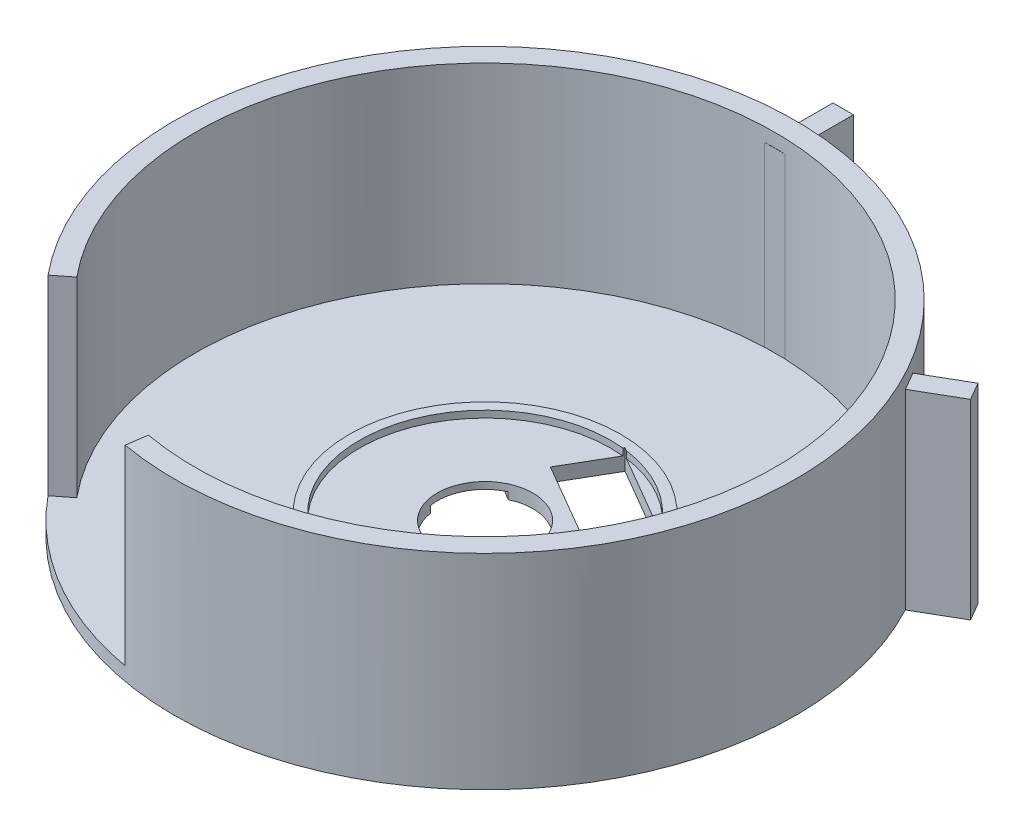
ISO-10303-21;
HEADER;
FILE_DESCRIPTION(('STEP AP214'),'2;1');
FILE_NAME('part.step','',(''),(''),'','','');
FILE_SCHEMA(('AUTOMOTIVE_DESIGN { 1 0 10303 214 1 1 1 1 }'));
ENDSEC;
DATA;
#1=APPLICATION_CONTEXT('core data for automotive mechanical design processes');
#2=APPLICATION_PROTOCOL_DEFINITION('international standard','automotive_design',2000,#1);
#3=PRODUCT_CONTEXT('',#1,'mechanical');
#4=PRODUCT('Part','Part','',(#3));
#5=PRODUCT_RELATED_PRODUCT_CATEGORY('part','',(#4));
#6=PRODUCT_DEFINITION_FORMATION('','',#4);
#7=PRODUCT_DEFINITION_CONTEXT('part definition',#1,'design');
#8=PRODUCT_DEFINITION('design','',#6,#7);
#9=PRODUCT_DEFINITION_SHAPE('','',#8);
#10=(LENGTH_UNIT() NAMED_UNIT(*) SI_UNIT(.MILLI.,.METRE.));
#11=(NAMED_UNIT(*) PLANE_ANGLE_UNIT() SI_UNIT($,.RADIAN.));
#12=(NAMED_UNIT(*) SI_UNIT($,.STERADIAN.) SOLID_ANGLE_UNIT());
#13=UNCERTAINTY_MEASURE_WITH_UNIT(LENGTH_MEASURE(1.E-05),#10,'distance_accuracy_value','');
#14=(GEOMETRIC_REPRESENTATION_CONTEXT(3) GLOBAL_UNCERTAINTY_ASSIGNED_CONTEXT((#13)) GLOBAL_UNIT_ASSIGNED_CONTEXT((#10,
#11,#12)) REPRESENTATION_CONTEXT('',''));
#15=CARTESIAN_POINT('',(0.,0.,0.));
#16=DIRECTION('',(0.,0.,1.));
#17=DIRECTION('',(1.,0.,0.));
#18=AXIS2_PLACEMENT_3D('',#15,#16,#17);
#19=CARTESIAN_POINT('',(0.,30.,0.));
#20=DIRECTION('',(0.,-1.,0.));
#21=DIRECTION('',(0.,0.,-1.));
#22=AXIS2_PLACEMENT_3D('',#19,#20,#21);
#23=CYLINDRICAL_SURFACE('',#22,42.5);
#24=CARTESIAN_POINT('',(0.,30.,0.));
#25=DIRECTION('',(0.,1.,0.));
#26=DIRECTION('',(0.,0.,1.));
#27=AXIS2_PLACEMENT_3D('',#24,#25,#26);
#28=CIRCLE('',#27,42.5);
#29=CARTESIAN_POINT('',(-7.50818253214453,30.,41.8315335012237));
#30=VERTEX_POINT('',#29);
#31=CARTESIAN_POINT('',(-32.8004509650978,30.,27.0255511782131));
#32=VERTEX_POINT('',#31);
#33=EDGE_CURVE('E461',#30,#32,#28,.T.);
#34=ORIENTED_EDGE('',*,*,#33,.T.);
#35=DIRECTION('',(0.,-1.,0.));
#36=VECTOR('',#35,1.);
#37=CARTESIAN_POINT('',(-32.8004509650978,30.,27.0255511782131));
#38=LINE('',#37,#36);
#39=CARTESIAN_POINT('',(-32.8004509650978,2.,27.0255511782131));
#40=VERTEX_POINT('',#39);
#41=EDGE_CURVE('E282',#32,#40,#38,.T.);
#42=ORIENTED_EDGE('',*,*,#41,.T.);
#43=CARTESIAN_POINT('',(0.,2.,0.));
#44=DIRECTION('',(0.,-1.,0.));
#45=DIRECTION('',(0.,0.,-1.));
#46=AXIS2_PLACEMENT_3D('',#43,#44,#45);
#47=CIRCLE('',#46,42.5);
#48=CARTESIAN_POINT('',(-1.49999999999974,2.,-42.4735211631906));
#49=VERTEX_POINT('',#48);
#50=EDGE_CURVE('E457',#40,#49,#47,.T.);
#51=ORIENTED_EDGE('',*,*,#50,.T.);
#52=DIRECTION('',(0.,1.,0.));
#53=VECTOR('',#52,1.);
#54=CARTESIAN_POINT('',(-1.49999999999974,0.,-42.4735211631906));
#55=LINE('',#54,#53);
#56=CARTESIAN_POINT('',(-1.49999999999974,28.,-42.4735211631906));
#57=VERTEX_POINT('',#56);
#58=EDGE_CURVE('E431',#49,#57,#55,.T.);
#59=ORIENTED_EDGE('',*,*,#58,.T.);
#60=CARTESIAN_POINT('',(0.,28.,0.));
#61=DIRECTION('',(0.,-1.,0.));
#62=DIRECTION('',(0.,0.,-1.));
#63=AXIS2_PLACEMENT_3D('',#60,#61,#62);
#64=CIRCLE('',#63,42.5);
#65=CARTESIAN_POINT('',(1.50000000000026,28.,-42.4735211631906));
#66=VERTEX_POINT('',#65);
#67=EDGE_CURVE('E450',#57,#66,#64,.T.);
#68=ORIENTED_EDGE('',*,*,#67,.T.);
#69=DIRECTION('',(0.,1.,0.));
#70=VECTOR('',#69,1.);
#71=CARTESIAN_POINT('',(1.50000000000026,0.,-42.4735211631906));
#72=LINE('',#71,#70);
#73=CARTESIAN_POINT('',(1.50000000000026,2.,-42.4735211631906));
#74=VERTEX_POINT('',#73);
#75=EDGE_CURVE('E430',#74,#66,#72,.T.);
#76=ORIENTED_EDGE('',*,*,#75,.F.);
#77=CARTESIAN_POINT('',(36.0331483154992,2.,-22.5357986872717));
#78=VERTEX_POINT('',#77);
#79=EDGE_CURVE('E466',#74,#78,#47,.T.);
#80=ORIENTED_EDGE('',*,*,#79,.T.);
#81=DIRECTION('',(0.,1.,0.));
#82=VECTOR('',#81,1.);
#83=CARTESIAN_POINT('',(36.0331483154992,0.,-22.5357986872717));
#84=LINE('',#83,#82);
#85=CARTESIAN_POINT('',(36.0331483154992,28.,-22.5357986872717));
#86=VERTEX_POINT('',#85);
#87=EDGE_CURVE('E381',#78,#86,#84,.T.);
#88=ORIENTED_EDGE('',*,*,#87,.T.);
#89=CARTESIAN_POINT('',(0.,28.,0.));
#90=DIRECTION('',(0.,-1.,0.));
#91=DIRECTION('',(0.,0.,-1.));
#92=AXIS2_PLACEMENT_3D('',#89,#90,#91);
#93=CIRCLE('',#92,42.5);
#94=CARTESIAN_POINT('',(37.5331483154988,28.,-19.9377224759191));
#95=VERTEX_POINT('',#94);
#96=EDGE_CURVE('E400',#86,#95,#93,.T.);
#97=ORIENTED_EDGE('',*,*,#96,.T.);
#98=DIRECTION('',(0.,1.,0.));
#99=VECTOR('',#98,1.);
#100=CARTESIAN_POINT('',(37.5331483154988,0.,-19.9377224759191));
#101=LINE('',#100,#99);
#102=CARTESIAN_POINT('',(37.5331483154988,2.,-19.9377224759191));
#103=VERTEX_POINT('',#102);
#104=EDGE_CURVE('E380',#103,#95,#101,.T.);
#105=ORIENTED_EDGE('',*,*,#104,.F.);
#106=CARTESIAN_POINT('',(-7.50818253214453,2.,41.8315335012237));
#107=VERTEX_POINT('',#106);
#108=EDGE_CURVE('E478',#103,#107,#47,.T.);
#109=ORIENTED_EDGE('',*,*,#108,.T.);
#110=DIRECTION('',(0.,-1.,0.));
#111=VECTOR('',#110,1.);
#112=CARTESIAN_POINT('',(-7.50818253214453,30.,41.8315335012237));
#113=LINE('',#112,#111);
#114=EDGE_CURVE('E274',#107,#30,#113,.F.);
#115=ORIENTED_EDGE('',*,*,#114,.T.);
#116=EDGE_LOOP('',(#34,#42,#51,#59,#68,#76,#80,#88,#97,#105,#109,#115));
#117=FACE_BOUND('',#116,.T.);
#118=ADVANCED_FACE('F39',(#117),#23,.F.);
#119=CARTESIAN_POINT('',(0.,30.,0.));
#120=DIRECTION('',(0.,1.,0.));
#121=DIRECTION('',(0.,0.,1.));
#122=AXIS2_PLACEMENT_3D('',#119,#120,#121);
#123=PLANE('',#122);
#124=CARTESIAN_POINT('',(0.,30.,0.));
#125=DIRECTION('',(0.,1.,0.));
#126=DIRECTION('',(0.,0.,1.));
#127=AXIS2_PLACEMENT_3D('',#124,#125,#126);
#128=CIRCLE('',#127,45.5);
#129=CARTESIAN_POINT('',(-7.92598309635751,30.,44.8043389858198));
#130=VERTEX_POINT('',#129);
#131=CARTESIAN_POINT('',(-35.1652264960856,30.,28.8731163104886));
#132=VERTEX_POINT('',#131);
#133=EDGE_CURVE('E467',#130,#132,#128,.T.);
#134=ORIENTED_EDGE('',*,*,#133,.T.);
#135=DIRECTION('',(0.788010753606721,0.,-0.61566147532566));
#136=VECTOR('',#135,1.);
#137=CARTESIAN_POINT('',(0.678736558687916,30.,0.868743178756121));
#138=LINE('',#137,#136);
#139=EDGE_CURVE('E278',#132,#32,#138,.T.);
#140=ORIENTED_EDGE('',*,*,#139,.T.);
#141=ORIENTED_EDGE('',*,*,#33,.F.);
#142=DIRECTION('',(-0.139173100960061,0.,0.990268068741571));
#143=VECTOR('',#142,1.);
#144=CARTESIAN_POINT('',(-1.59758876118056,30.,-0.224526458007468));
#145=LINE('',#144,#143);
#146=EDGE_CURVE('E270',#30,#130,#145,.T.);
#147=ORIENTED_EDGE('',*,*,#146,.T.);
#148=EDGE_LOOP('',(#134,#140,#141,#147));
#149=FACE_BOUND('',#148,.T.);
#150=ADVANCED_FACE('F526',(#149),#123,.T.);
#151=CARTESIAN_POINT('',(0.,30.,0.));
#152=DIRECTION('',(0.,-1.,0.));
#153=DIRECTION('',(0.,0.,-1.));
#154=AXIS2_PLACEMENT_3D('',#151,#152,#153);
#155=CYLINDRICAL_SURFACE('',#154,45.5);
#156=CARTESIAN_POINT('',(0.,28.,0.));
#157=DIRECTION('',(0.,-1.,0.));
#158=DIRECTION('',(0.,0.,-1.));
#159=AXIS2_PLACEMENT_3D('',#156,#157,#158);
#160=CIRCLE('',#159,45.5);
#161=CARTESIAN_POINT('',(38.6327373350306,28.,-24.0366721074805));
#162=VERTEX_POINT('',#161);
#163=CARTESIAN_POINT('',(40.1327373350302,28.,-21.438595896128));
#164=VERTEX_POINT('',#163);
#165=EDGE_CURVE('E490',#162,#164,#160,.T.);
#166=ORIENTED_EDGE('',*,*,#165,.F.);
#167=DIRECTION('',(0.,-1.,0.));
#168=VECTOR('',#167,1.);
#169=CARTESIAN_POINT('',(38.6327373350306,30.,-24.0366721074805));
#170=LINE('',#169,#168);
#171=CARTESIAN_POINT('',(38.6327373350306,0.,-24.0366721074805));
#172=VERTEX_POINT('',#171);
#173=EDGE_CURVE('E397',#162,#172,#170,.T.);
#174=ORIENTED_EDGE('',*,*,#173,.T.);
#175=CARTESIAN_POINT('',(0.,0.,0.));
#176=DIRECTION('',(0.,1.,0.));
#177=DIRECTION('',(0.,0.,1.));
#178=AXIS2_PLACEMENT_3D('',#175,#176,#177);
#179=CIRCLE('',#178,45.5);
#180=CARTESIAN_POINT('',(1.50000000000027,0.,-45.4752680036083));
#181=VERTEX_POINT('',#180);
#182=EDGE_CURVE('E465',#172,#181,#179,.T.);
#183=ORIENTED_EDGE('',*,*,#182,.T.);
#184=DIRECTION('',(0.,-1.,0.));
#185=VECTOR('',#184,1.);
#186=CARTESIAN_POINT('',(1.50000000000027,30.,-45.4752680036083));
#187=LINE('',#186,#185);
#188=CARTESIAN_POINT('',(1.50000000000027,28.,-45.4752680036083));
#189=VERTEX_POINT('',#188);
#190=EDGE_CURVE('E435',#181,#189,#187,.F.);
#191=ORIENTED_EDGE('',*,*,#190,.T.);
#192=CARTESIAN_POINT('',(0.,28.,0.));
#193=DIRECTION('',(0.,-1.,0.));
#194=DIRECTION('',(0.,0.,-1.));
#195=AXIS2_PLACEMENT_3D('',#192,#193,#194);
#196=CIRCLE('',#195,45.5);
#197=CARTESIAN_POINT('',(-1.49999999999972,28.,-45.4752680036083));
#198=VERTEX_POINT('',#197);
#199=EDGE_CURVE('E482',#198,#189,#196,.T.);
#200=ORIENTED_EDGE('',*,*,#199,.F.);
#201=DIRECTION('',(0.,-1.,0.));
#202=VECTOR('',#201,1.);
#203=CARTESIAN_POINT('',(-1.49999999999972,30.,-45.4752680036083));
#204=LINE('',#203,#202);
#205=CARTESIAN_POINT('',(-1.49999999999972,0.,-45.4752680036083));
#206=VERTEX_POINT('',#205);
#207=EDGE_CURVE('E447',#198,#206,#204,.T.);
#208=ORIENTED_EDGE('',*,*,#207,.T.);
#209=CARTESIAN_POINT('',(40.1327373350302,0.,-21.438595896128));
#210=VERTEX_POINT('',#209);
#211=EDGE_CURVE('E472',#206,#210,#179,.T.);
#212=ORIENTED_EDGE('',*,*,#211,.T.);
#213=DIRECTION('',(0.,-1.,0.));
#214=VECTOR('',#213,1.);
#215=CARTESIAN_POINT('',(40.1327373350302,30.,-21.438595896128));
#216=LINE('',#215,#214);
#217=EDGE_CURVE('E385',#210,#164,#216,.F.);
#218=ORIENTED_EDGE('',*,*,#217,.T.);
#219=EDGE_LOOP('',(#166,#174,#183,#191,#200,#208,#212,#218));
#220=FACE_BOUND('',#219,.T.);
#221=DIRECTION('',(0.,-1.,0.));
#222=VECTOR('',#221,1.);
#223=CARTESIAN_POINT('',(-35.1652264960856,60.5,28.8731163104886));
#224=LINE('',#223,#222);
#225=CARTESIAN_POINT('',(-35.1652264960856,2.,28.8731163104886));
#226=VERTEX_POINT('',#225);
#227=EDGE_CURVE('E267',#132,#226,#224,.T.);
#228=ORIENTED_EDGE('',*,*,#227,.F.);
#229=ORIENTED_EDGE('',*,*,#133,.F.);
#230=DIRECTION('',(0.,-1.,0.));
#231=VECTOR('',#230,1.);
#232=CARTESIAN_POINT('',(-7.92598309635751,60.5,44.8043389858198));
#233=LINE('',#232,#231);
#234=CARTESIAN_POINT('',(-7.92598309635751,2.,44.8043389858198));
#235=VERTEX_POINT('',#234);
#236=EDGE_CURVE('E263',#130,#235,#233,.T.);
#237=ORIENTED_EDGE('',*,*,#236,.T.);
#238=CARTESIAN_POINT('',(0.,2.,0.));
#239=DIRECTION('',(0.,-1.,0.));
#240=DIRECTION('',(0.,0.,-1.));
#241=AXIS2_PLACEMENT_3D('',#238,#239,#240);
#242=CIRCLE('',#241,45.5);
#243=EDGE_CURVE('E231',#235,#226,#242,.T.);
#244=ORIENTED_EDGE('',*,*,#243,.T.);
#245=EDGE_LOOP('',(#228,#229,#237,#244));
#246=FACE_BOUND('',#245,.T.);
#247=ADVANCED_FACE('F41',(#220,#246),#155,.T.);
#248=CARTESIAN_POINT('',(0.,2.,0.));
#249=DIRECTION('',(0.,-1.,0.));
#250=DIRECTION('',(0.,0.,-1.));
#251=AXIS2_PLACEMENT_3D('',#248,#249,#250);
#252=PLANE('',#251);
#253=CARTESIAN_POINT('',(0.,2.,0.));
#254=DIRECTION('',(0.,1.,0.));
#255=DIRECTION('',(0.,0.,1.));
#256=AXIS2_PLACEMENT_3D('',#253,#254,#255);
#257=CIRCLE('',#256,7.);
#258=CARTESIAN_POINT('',(0.,2.,7.));
#259=VERTEX_POINT('',#258);
#260=EDGE_CURVE('E454',#259,#259,#257,.T.);
#261=ORIENTED_EDGE('',*,*,#260,.F.);
#262=EDGE_LOOP('',(#261));
#263=FACE_BOUND('',#262,.T.);
#264=DIRECTION('',(-0.864345338631781,0.,-0.502898732932895));
#265=VECTOR('',#264,1.);
#266=CARTESIAN_POINT('',(4.52608859639606,2.,-7.77910804768603));
#267=LINE('',#266,#265);
#268=CARTESIAN_POINT('',(10.9586774046728,2.,-4.03645957539663));
#269=VERTEX_POINT('',#268);
#270=CARTESIAN_POINT('',(-2.00650267480392,2.,-11.5799405693901));
#271=VERTEX_POINT('',#270);
#272=EDGE_CURVE('E336',#269,#271,#267,.T.);
#273=ORIENTED_EDGE('',*,*,#272,.T.);
#274=DIRECTION('',(0.502898732932895,0.,-0.864345338631781));
#275=VECTOR('',#274,1.);
#276=CARTESIAN_POINT('',(-6.53259127119998,2.,-3.80083252170404));
#277=LINE('',#276,#275);
#278=CARTESIAN_POINT('',(1.89868436966206,2.,-18.2918887158568));
#279=VERTEX_POINT('',#278);
#280=EDGE_CURVE('E332',#271,#279,#277,.T.);
#281=ORIENTED_EDGE('',*,*,#280,.T.);
#282=CARTESIAN_POINT('',(0.,2.,0.));
#283=DIRECTION('',(0.,1.,0.));
#284=DIRECTION('',(0.,0.,1.));
#285=AXIS2_PLACEMENT_3D('',#282,#283,#284);
#286=CIRCLE('',#285,18.3901657178201);
#287=CARTESIAN_POINT('',(14.8898530942682,2.,-10.7930750928546));
#288=VERTEX_POINT('',#287);
#289=EDGE_CURVE('E340',#279,#288,#286,.T.);
#290=ORIENTED_EDGE('',*,*,#289,.T.);
#291=DIRECTION('',(-0.502898732932895,0.,0.864345338631781));
#292=VECTOR('',#291,1.);
#293=CARTESIAN_POINT('',(6.43258880827674,2.,3.7426484722894));
#294=LINE('',#293,#292);
#295=EDGE_CURVE('E325',#288,#269,#294,.T.);
#296=ORIENTED_EDGE('',*,*,#295,.T.);
#297=EDGE_LOOP('',(#273,#281,#290,#296));
#298=FACE_BOUND('',#297,.T.);
#299=ADVANCED_FACE('F600',(#263,#298),#252,.F.);
#300=CARTESIAN_POINT('',(0.,3.,0.));
#301=DIRECTION('',(0.,-1.,0.));
#302=DIRECTION('',(0.,0.,-1.));
#303=AXIS2_PLACEMENT_3D('',#300,#301,#302);
#304=CYLINDRICAL_SURFACE('',#303,18.3901657178201);
#305=DIRECTION('',(0.,-1.,0.));
#306=VECTOR('',#305,1.);
#307=CARTESIAN_POINT('',(1.89868436966206,3.,-18.2918887158568));
#308=LINE('',#307,#306);
#309=CARTESIAN_POINT('',(1.89868436966206,3.,-18.2918887158568));
#310=VERTEX_POINT('',#309);
#311=EDGE_CURVE('E507',#310,#279,#308,.T.);
#312=ORIENTED_EDGE('',*,*,#311,.F.);
#313=CARTESIAN_POINT('',(0.,3.,0.));
#314=DIRECTION('',(0.,1.,0.));
#315=DIRECTION('',(0.,0.,1.));
#316=AXIS2_PLACEMENT_3D('',#313,#314,#315);
#317=CIRCLE('',#316,18.3901657178201);
#318=CARTESIAN_POINT('',(14.8898530942682,3.,-10.7930750928546));
#319=VERTEX_POINT('',#318);
#320=EDGE_CURVE('E341',#310,#319,#317,.T.);
#321=ORIENTED_EDGE('',*,*,#320,.T.);
#322=DIRECTION('',(0.,-1.,0.));
#323=VECTOR('',#322,1.);
#324=CARTESIAN_POINT('',(14.8898530942682,3.,-10.7930750928546));
#325=LINE('',#324,#323);
#326=EDGE_CURVE('E504',#288,#319,#325,.F.);
#327=ORIENTED_EDGE('',*,*,#326,.F.);
#328=ORIENTED_EDGE('',*,*,#289,.F.);
#329=EDGE_LOOP('',(#312,#321,#327,#328));
#330=FACE_BOUND('',#329,.T.);
#331=ADVANCED_FACE('F601',(#330),#304,.F.);
#332=CARTESIAN_POINT('',(14.6119198415396,2.,-11.1664673766285));
#333=VERTEX_POINT('',#332);
#334=CARTESIAN_POINT('',(2.48663707817889,2.,-18.221274136852));
#335=VERTEX_POINT('',#334);
#336=EDGE_CURVE('E346',#333,#335,#286,.T.);
#337=ORIENTED_EDGE('',*,*,#336,.T.);
#338=DIRECTION('',(0.864345338631781,0.,0.502898732932895));
#339=VECTOR('',#338,1.);
#340=CARTESIAN_POINT('',(8.54927845985922,2.,-14.6938707567403));
#341=LINE('',#340,#339);
#342=EDGE_CURVE('E317',#335,#333,#341,.T.);
#343=ORIENTED_EDGE('',*,*,#342,.T.);
#344=EDGE_LOOP('',(#337,#343));
#345=FACE_BOUND('',#344,.T.);
#346=ADVANCED_FACE('F594',(#345),#252,.F.);
#347=CARTESIAN_POINT('',(0.,0.,0.));
#348=DIRECTION('',(0.,1.,0.));
#349=DIRECTION('',(0.,0.,1.));
#350=AXIS2_PLACEMENT_3D('',#347,#348,#349);
#351=PLANE('',#350);
#352=DIRECTION('',(0.864345338631781,0.,0.502898732932895));
#353=VECTOR('',#352,1.);
#354=CARTESIAN_POINT('',(2.01668718865924,0.,-18.4947032784443));
#355=LINE('',#354,#353);
#356=CARTESIAN_POINT('',(2.01668718865924,0.,-18.4947032784443));
#357=VERTEX_POINT('',#356);
#358=CARTESIAN_POINT('',(14.981867268136,0.,-10.9512222844509));
#359=VERTEX_POINT('',#358);
#360=EDGE_CURVE('E289',#357,#359,#355,.T.);
#361=ORIENTED_EDGE('',*,*,#360,.F.);
#362=DIRECTION('',(0.502898732932895,0.,-0.864345338631781));
#363=VECTOR('',#362,1.);
#364=CARTESIAN_POINT('',(2.01668718865924,0.,-18.4947032784443));
#365=LINE('',#364,#363);
#366=CARTESIAN_POINT('',(-2.00650267480392,0.,-11.5799405693901));
#367=VERTEX_POINT('',#366);
#368=EDGE_CURVE('E286',#367,#357,#365,.T.);
#369=ORIENTED_EDGE('',*,*,#368,.F.);
#370=DIRECTION('',(-0.864345338631781,0.,-0.502898732932895));
#371=VECTOR('',#370,1.);
#372=CARTESIAN_POINT('',(-2.00650267480392,0.,-11.5799405693901));
#373=LINE('',#372,#371);
#374=CARTESIAN_POINT('',(10.9586774046728,0.,-4.03645957539663));
#375=VERTEX_POINT('',#374);
#376=EDGE_CURVE('E297',#375,#367,#373,.T.);
#377=ORIENTED_EDGE('',*,*,#376,.F.);
#378=DIRECTION('',(-0.502898732932896,0.,0.864345338631781));
#379=VECTOR('',#378,1.);
#380=CARTESIAN_POINT('',(14.981867268136,0.,-10.9512222844509));
#381=LINE('',#380,#379);
#382=EDGE_CURVE('E293',#359,#375,#381,.T.);
#383=ORIENTED_EDGE('',*,*,#382,.F.);
#384=EDGE_LOOP('',(#361,#369,#377,#383));
#385=FACE_BOUND('',#384,.T.);
#386=CARTESIAN_POINT('',(0.,0.,0.));
#387=DIRECTION('',(0.,1.,0.));
#388=DIRECTION('',(0.,0.,1.));
#389=AXIS2_PLACEMENT_3D('',#386,#387,#388);
#390=CIRCLE('',#389,7.);
#391=CARTESIAN_POINT('',(-6.91226534619207,0.,1.10480214691692));
#392=VERTEX_POINT('',#391);
#393=CARTESIAN_POINT('',(-2.96019924007833,0.,-6.34328152134522));
#394=VERTEX_POINT('',#393);
#395=EDGE_CURVE('E247',#392,#394,#390,.T.);
#396=ORIENTED_EDGE('',*,*,#395,.T.);
#397=DIRECTION('',(0.85293682845598,0.,0.522014144122028));
#398=VECTOR('',#397,1.);
#399=CARTESIAN_POINT('',(-2.51910953449813,0.,-6.07332593089862));
#400=LINE('',#399,#398);
#401=CARTESIAN_POINT('',(-19.8144830178494,0.,-16.6584352672208));
#402=VERTEX_POINT('',#401);
#403=EDGE_CURVE('E241',#402,#394,#400,.T.);
#404=ORIENTED_EDGE('',*,*,#403,.F.);
#405=DIRECTION('',(0.522014144122029,0.,-0.85293682845598));
#406=VECTOR('',#405,1.);
#407=CARTESIAN_POINT('',(-24.2076388295433,0.,-9.48030718940525));
#408=LINE('',#407,#406);
#409=CARTESIAN_POINT('',(-24.2076388295433,0.,-9.48030718940525));
#410=VERTEX_POINT('',#409);
#411=EDGE_CURVE('E611',#410,#402,#408,.T.);
#412=ORIENTED_EDGE('',*,*,#411,.F.);
#413=DIRECTION('',(-0.85293682845598,0.,-0.522014144122028));
#414=VECTOR('',#413,1.);
#415=CARTESIAN_POINT('',(-6.91226534619207,0.,1.10480214691692));
#416=LINE('',#415,#414);
#417=EDGE_CURVE('E609',#392,#410,#416,.T.);
#418=ORIENTED_EDGE('',*,*,#417,.F.);
#419=EDGE_LOOP('',(#396,#404,#412,#418));
#420=FACE_BOUND('',#419,.T.);
#421=ORIENTED_EDGE('',*,*,#182,.F.);
#422=DIRECTION('',(-0.866025403784438,0.,0.500000000000001));
#423=VECTOR('',#422,1.);
#424=CARTESIAN_POINT('',(44.6934023533436,0.,-27.5357986872717));
#425=LINE('',#424,#423);
#426=CARTESIAN_POINT('',(44.6934023533436,0.,-27.5357986872717));
#427=VERTEX_POINT('',#426);
#428=EDGE_CURVE('E376',#427,#172,#425,.T.);
#429=ORIENTED_EDGE('',*,*,#428,.F.);
#430=DIRECTION('',(-0.500000000000001,0.,-0.866025403784438));
#431=VECTOR('',#430,1.);
#432=CARTESIAN_POINT('',(46.1934023533432,0.,-24.9377224759191));
#433=LINE('',#432,#431);
#434=CARTESIAN_POINT('',(46.1934023533432,0.,-24.9377224759191));
#435=VERTEX_POINT('',#434);
#436=EDGE_CURVE('E372',#435,#427,#433,.T.);
#437=ORIENTED_EDGE('',*,*,#436,.F.);
#438=DIRECTION('',(0.866025403784438,0.,-0.500000000000001));
#439=VECTOR('',#438,1.);
#440=CARTESIAN_POINT('',(46.1934023533432,0.,-24.9377224759191));
#441=LINE('',#440,#439);
#442=EDGE_CURVE('E369',#210,#435,#441,.T.);
#443=ORIENTED_EDGE('',*,*,#442,.F.);
#444=ORIENTED_EDGE('',*,*,#211,.F.);
#445=DIRECTION('',(0.,0.,1.));
#446=VECTOR('',#445,1.);
#447=CARTESIAN_POINT('',(-1.49999999999968,0.,-52.4735211631906));
#448=LINE('',#447,#446);
#449=CARTESIAN_POINT('',(-1.49999999999968,0.,-52.4735211631906));
#450=VERTEX_POINT('',#449);
#451=EDGE_CURVE('E426',#450,#206,#448,.T.);
#452=ORIENTED_EDGE('',*,*,#451,.F.);
#453=DIRECTION('',(-1.,0.,0.));
#454=VECTOR('',#453,1.);
#455=CARTESIAN_POINT('',(1.50000000000032,0.,-52.4735211631906));
#456=LINE('',#455,#454);
#457=CARTESIAN_POINT('',(1.50000000000032,0.,-52.4735211631906));
#458=VERTEX_POINT('',#457);
#459=EDGE_CURVE('E422',#458,#450,#456,.T.);
#460=ORIENTED_EDGE('',*,*,#459,.F.);
#461=DIRECTION('',(0.,0.,-1.));
#462=VECTOR('',#461,1.);
#463=CARTESIAN_POINT('',(1.50000000000032,0.,-52.4735211631906));
#464=LINE('',#463,#462);
#465=EDGE_CURVE('E419',#181,#458,#464,.T.);
#466=ORIENTED_EDGE('',*,*,#465,.F.);
#467=EDGE_LOOP('',(#421,#429,#437,#443,#444,#452,#460,#466));
#468=FACE_BOUND('',#467,.T.);
#469=ADVANCED_FACE('F546',(#385,#420,#468),#351,.F.);
#470=ORIENTED_EDGE('',*,*,#50,.F.);
#471=DIRECTION('',(-0.788010753606721,0.,0.61566147532566));
#472=VECTOR('',#471,1.);
#473=CARTESIAN_POINT('',(-32.6066002919151,2.,26.8740984335667));
#474=LINE('',#473,#472);
#475=EDGE_CURVE('E63',#40,#226,#474,.T.);
#476=ORIENTED_EDGE('',*,*,#475,.T.);
#477=ORIENTED_EDGE('',*,*,#243,.F.);
#478=DIRECTION('',(0.139173100960061,0.,-0.990268068741571));
#479=VECTOR('',#478,1.);
#480=CARTESIAN_POINT('',(-7.49515502918447,2.,41.7388380011034));
#481=LINE('',#480,#479);
#482=EDGE_CURVE('E259',#235,#107,#481,.T.);
#483=ORIENTED_EDGE('',*,*,#482,.T.);
#484=ORIENTED_EDGE('',*,*,#108,.F.);
#485=DIRECTION('',(-0.500000000000004,0.,-0.866025403784437));
#486=VECTOR('',#485,1.);
#487=CARTESIAN_POINT('',(36.783148315499,2.,-21.2367605815955));
#488=LINE('',#487,#486);
#489=EDGE_CURVE('E486',#103,#78,#488,.T.);
#490=ORIENTED_EDGE('',*,*,#489,.T.);
#491=ORIENTED_EDGE('',*,*,#79,.F.);
#492=DIRECTION('',(-1.,0.,0.));
#493=VECTOR('',#492,1.);
#494=CARTESIAN_POINT('',(2.94719257076738E-13,2.,-42.4735211631906));
#495=LINE('',#494,#493);
#496=EDGE_CURVE('E471',#74,#49,#495,.T.);
#497=ORIENTED_EDGE('',*,*,#496,.T.);
#498=EDGE_LOOP('',(#470,#476,#477,#483,#484,#490,#491,#497));
#499=FACE_BOUND('',#498,.T.);
#500=CARTESIAN_POINT('',(0.,2.,0.));
#501=DIRECTION('',(0.,-1.,0.));
#502=DIRECTION('',(0.,0.,-1.));
#503=AXIS2_PLACEMENT_3D('',#500,#501,#502);
#504=CIRCLE('',#503,19.8901657178201);
#505=CARTESIAN_POINT('',(0.,2.,-19.8901657178201));
#506=VERTEX_POINT('',#505);
#507=EDGE_CURVE('E494',#506,#506,#504,.F.);
#508=ORIENTED_EDGE('',*,*,#507,.F.);
#509=EDGE_LOOP('',(#508));
#510=FACE_BOUND('',#509,.T.);
#511=ADVANCED_FACE('F516',(#499,#510),#252,.F.);
#512=CARTESIAN_POINT('',(0.,0.,0.));
#513=DIRECTION('',(0.,1.,0.));
#514=DIRECTION('',(0.,0.,1.));
#515=AXIS2_PLACEMENT_3D('',#512,#513,#514);
#516=CYLINDRICAL_SURFACE('',#515,7.);
#517=CARTESIAN_POINT('',(0.,1.,0.));
#518=DIRECTION('',(0.,1.,0.));
#519=DIRECTION('',(0.,0.,1.));
#520=AXIS2_PLACEMENT_3D('',#517,#518,#519);
#521=CIRCLE('',#520,7.);
#522=CARTESIAN_POINT('',(-6.91226534619207,1.,1.10480214691692));
#523=VERTEX_POINT('',#522);
#524=CARTESIAN_POINT('',(-2.96019924007833,1.,-6.34328152134522));
#525=VERTEX_POINT('',#524);
#526=EDGE_CURVE('E48',#523,#525,#521,.F.);
#527=ORIENTED_EDGE('',*,*,#526,.T.);
#528=DIRECTION('',(0.,1.,0.));
#529=VECTOR('',#528,1.);
#530=CARTESIAN_POINT('',(-2.96019924007833,0.,-6.34328152134522));
#531=LINE('',#530,#529);
#532=EDGE_CURVE('E11',#525,#394,#531,.F.);
#533=ORIENTED_EDGE('',*,*,#532,.T.);
#534=ORIENTED_EDGE('',*,*,#395,.F.);
#535=DIRECTION('',(0.,-1.,0.));
#536=VECTOR('',#535,1.);
#537=CARTESIAN_POINT('',(-6.91226534619207,1.,1.10480214691692));
#538=LINE('',#537,#536);
#539=EDGE_CURVE('E235',#523,#392,#538,.T.);
#540=ORIENTED_EDGE('',*,*,#539,.F.);
#541=EDGE_LOOP('',(#527,#533,#534,#540));
#542=FACE_BOUND('',#541,.T.);
#543=ORIENTED_EDGE('',*,*,#260,.T.);
#544=EDGE_LOOP('',(#543));
#545=FACE_BOUND('',#544,.T.);
#546=ADVANCED_FACE('F244',(#542,#545),#516,.F.);
#547=CARTESIAN_POINT('',(-1.49999999999974,0.,-42.4735211631906));
#548=DIRECTION('',(0.,0.,1.));
#549=DIRECTION('',(1.,0.,0.));
#550=AXIS2_PLACEMENT_3D('',#547,#548,#549);
#551=PLANE('',#550);
#552=ORIENTED_EDGE('',*,*,#496,.F.);
#553=ORIENTED_EDGE('',*,*,#75,.T.);
#554=DIRECTION('',(1.,0.,0.));
#555=VECTOR('',#554,1.);
#556=CARTESIAN_POINT('',(-1.49999999999974,28.,-42.4735211631906));
#557=LINE('',#556,#555);
#558=EDGE_CURVE('E404',#57,#66,#557,.T.);
#559=ORIENTED_EDGE('',*,*,#558,.F.);
#560=ORIENTED_EDGE('',*,*,#58,.F.);
#561=EDGE_LOOP('',(#552,#553,#559,#560));
#562=FACE_BOUND('',#561,.T.);
#563=ADVANCED_FACE('F685',(#562),#551,.T.);
#564=CARTESIAN_POINT('',(0.,28.,0.));
#565=DIRECTION('',(0.,-1.,0.));
#566=DIRECTION('',(0.,0.,-1.));
#567=AXIS2_PLACEMENT_3D('',#564,#565,#566);
#568=PLANE('',#567);
#569=ORIENTED_EDGE('',*,*,#67,.F.);
#570=ORIENTED_EDGE('',*,*,#558,.T.);
#571=EDGE_LOOP('',(#569,#570));
#572=FACE_BOUND('',#571,.T.);
#573=ADVANCED_FACE('F678',(#572),#568,.F.);
#574=CARTESIAN_POINT('',(-1.49999999999968,0.,-52.4735211631906));
#575=DIRECTION('',(-1.,0.,0.));
#576=DIRECTION('',(0.,0.,1.));
#577=AXIS2_PLACEMENT_3D('',#574,#575,#576);
#578=PLANE('',#577);
#579=ORIENTED_EDGE('',*,*,#207,.F.);
#580=DIRECTION('',(0.,0.,1.));
#581=VECTOR('',#580,1.);
#582=CARTESIAN_POINT('',(-1.49999999999968,28.,-52.4735211631906));
#583=LINE('',#582,#581);
#584=CARTESIAN_POINT('',(-1.49999999999968,28.,-52.4735211631906));
#585=VERTEX_POINT('',#584);
#586=EDGE_CURVE('E415',#585,#198,#583,.T.);
#587=ORIENTED_EDGE('',*,*,#586,.F.);
#588=DIRECTION('',(0.,1.,0.));
#589=VECTOR('',#588,1.);
#590=CARTESIAN_POINT('',(-1.49999999999968,0.,-52.4735211631906));
#591=LINE('',#590,#589);
#592=EDGE_CURVE('E436',#450,#585,#591,.T.);
#593=ORIENTED_EDGE('',*,*,#592,.F.);
#594=ORIENTED_EDGE('',*,*,#451,.T.);
#595=EDGE_LOOP('',(#579,#587,#593,#594));
#596=FACE_BOUND('',#595,.T.);
#597=ADVANCED_FACE('F557',(#596),#578,.T.);
#598=CARTESIAN_POINT('',(1.50000000000032,0.,-52.4735211631906));
#599=DIRECTION('',(1.,0.,0.));
#600=DIRECTION('',(0.,0.,-1.));
#601=AXIS2_PLACEMENT_3D('',#598,#599,#600);
#602=PLANE('',#601);
#603=ORIENTED_EDGE('',*,*,#190,.F.);
#604=ORIENTED_EDGE('',*,*,#465,.T.);
#605=DIRECTION('',(0.,1.,0.));
#606=VECTOR('',#605,1.);
#607=CARTESIAN_POINT('',(1.50000000000032,0.,-52.4735211631906));
#608=LINE('',#607,#606);
#609=CARTESIAN_POINT('',(1.50000000000032,28.,-52.4735211631906));
#610=VERTEX_POINT('',#609);
#611=EDGE_CURVE('E439',#458,#610,#608,.T.);
#612=ORIENTED_EDGE('',*,*,#611,.T.);
#613=DIRECTION('',(0.,0.,-1.));
#614=VECTOR('',#613,1.);
#615=CARTESIAN_POINT('',(1.50000000000032,28.,-52.4735211631906));
#616=LINE('',#615,#614);
#617=EDGE_CURVE('E408',#189,#610,#616,.T.);
#618=ORIENTED_EDGE('',*,*,#617,.F.);
#619=EDGE_LOOP('',(#603,#604,#612,#618));
#620=FACE_BOUND('',#619,.T.);
#621=ADVANCED_FACE('F543',(#620),#602,.T.);
#622=CARTESIAN_POINT('',(1.50000000000032,0.,-52.4735211631906));
#623=DIRECTION('',(0.,0.,-1.));
#624=DIRECTION('',(-1.,0.,0.));
#625=AXIS2_PLACEMENT_3D('',#622,#623,#624);
#626=PLANE('',#625);
#627=ORIENTED_EDGE('',*,*,#592,.T.);
#628=DIRECTION('',(-1.,0.,0.));
#629=VECTOR('',#628,1.);
#630=CARTESIAN_POINT('',(1.50000000000032,28.,-52.4735211631906));
#631=LINE('',#630,#629);
#632=EDGE_CURVE('E411',#610,#585,#631,.T.);
#633=ORIENTED_EDGE('',*,*,#632,.F.);
#634=ORIENTED_EDGE('',*,*,#611,.F.);
#635=ORIENTED_EDGE('',*,*,#459,.T.);
#636=EDGE_LOOP('',(#627,#633,#634,#635));
#637=FACE_BOUND('',#636,.T.);
#638=ADVANCED_FACE('F550',(#637),#626,.T.);
#639=ORIENTED_EDGE('',*,*,#586,.T.);
#640=ORIENTED_EDGE('',*,*,#199,.T.);
#641=ORIENTED_EDGE('',*,*,#617,.T.);
#642=ORIENTED_EDGE('',*,*,#632,.T.);
#643=EDGE_LOOP('',(#639,#640,#641,#642));
#644=FACE_BOUND('',#643,.T.);
#645=ADVANCED_FACE('F554',(#644),#568,.F.);
#646=CARTESIAN_POINT('',(36.0331483154992,0.,-22.5357986872717));
#647=DIRECTION('',(-0.866025403784437,0.,0.500000000000003));
#648=DIRECTION('',(0.500000000000004,0.,0.866025403784437));
#649=AXIS2_PLACEMENT_3D('',#646,#647,#648);
#650=PLANE('',#649);
#651=ORIENTED_EDGE('',*,*,#489,.F.);
#652=ORIENTED_EDGE('',*,*,#104,.T.);
#653=DIRECTION('',(0.500000000000003,0.,0.866025403784437));
#654=VECTOR('',#653,1.);
#655=CARTESIAN_POINT('',(36.0331483154992,28.,-22.5357986872717));
#656=LINE('',#655,#654);
#657=EDGE_CURVE('E354',#86,#95,#656,.T.);
#658=ORIENTED_EDGE('',*,*,#657,.F.);
#659=ORIENTED_EDGE('',*,*,#87,.F.);
#660=EDGE_LOOP('',(#651,#652,#658,#659));
#661=FACE_BOUND('',#660,.T.);
#662=ADVANCED_FACE('F581',(#661),#650,.T.);
#663=CARTESIAN_POINT('',(0.,28.,0.));
#664=DIRECTION('',(0.,-1.,0.));
#665=DIRECTION('',(0.,0.,-1.));
#666=AXIS2_PLACEMENT_3D('',#663,#664,#665);
#667=PLANE('',#666);
#668=ORIENTED_EDGE('',*,*,#96,.F.);
#669=ORIENTED_EDGE('',*,*,#657,.T.);
#670=EDGE_LOOP('',(#668,#669));
#671=FACE_BOUND('',#670,.T.);
#672=ADVANCED_FACE('F574',(#671),#667,.F.);
#673=CARTESIAN_POINT('',(44.6934023533436,0.,-27.5357986872717));
#674=DIRECTION('',(-0.500000000000001,0.,-0.866025403784438));
#675=DIRECTION('',(-0.866025403784438,0.,0.500000000000001));
#676=AXIS2_PLACEMENT_3D('',#673,#674,#675);
#677=PLANE('',#676);
#678=ORIENTED_EDGE('',*,*,#173,.F.);
#679=DIRECTION('',(-0.866025403784438,0.,0.500000000000001));
#680=VECTOR('',#679,1.);
#681=CARTESIAN_POINT('',(44.6934023533436,28.,-27.5357986872717));
#682=LINE('',#681,#680);
#683=CARTESIAN_POINT('',(44.6934023533436,28.,-27.5357986872717));
#684=VERTEX_POINT('',#683);
#685=EDGE_CURVE('E365',#684,#162,#682,.T.);
#686=ORIENTED_EDGE('',*,*,#685,.F.);
#687=DIRECTION('',(0.,1.,0.));
#688=VECTOR('',#687,1.);
#689=CARTESIAN_POINT('',(44.6934023533436,0.,-27.5357986872717));
#690=LINE('',#689,#688);
#691=EDGE_CURVE('E386',#427,#684,#690,.T.);
#692=ORIENTED_EDGE('',*,*,#691,.F.);
#693=ORIENTED_EDGE('',*,*,#428,.T.);
#694=EDGE_LOOP('',(#678,#686,#692,#693));
#695=FACE_BOUND('',#694,.T.);
#696=ADVANCED_FACE('F572',(#695),#677,.T.);
#697=CARTESIAN_POINT('',(46.1934023533432,0.,-24.9377224759191));
#698=DIRECTION('',(0.500000000000001,0.,0.866025403784438));
#699=DIRECTION('',(0.866025403784438,0.,-0.500000000000001));
#700=AXIS2_PLACEMENT_3D('',#697,#698,#699);
#701=PLANE('',#700);
#702=ORIENTED_EDGE('',*,*,#217,.F.);
#703=ORIENTED_EDGE('',*,*,#442,.T.);
#704=DIRECTION('',(0.,1.,0.));
#705=VECTOR('',#704,1.);
#706=CARTESIAN_POINT('',(46.1934023533432,0.,-24.9377224759191));
#707=LINE('',#706,#705);
#708=CARTESIAN_POINT('',(46.1934023533432,28.,-24.9377224759191));
#709=VERTEX_POINT('',#708);
#710=EDGE_CURVE('E389',#435,#709,#707,.T.);
#711=ORIENTED_EDGE('',*,*,#710,.T.);
#712=DIRECTION('',(0.866025403784438,0.,-0.500000000000001));
#713=VECTOR('',#712,1.);
#714=CARTESIAN_POINT('',(46.1934023533432,28.,-24.9377224759191));
#715=LINE('',#714,#713);
#716=EDGE_CURVE('E358',#164,#709,#715,.T.);
#717=ORIENTED_EDGE('',*,*,#716,.F.);
#718=EDGE_LOOP('',(#702,#703,#711,#717));
#719=FACE_BOUND('',#718,.T.);
#720=ADVANCED_FACE('F563',(#719),#701,.T.);
#721=CARTESIAN_POINT('',(46.1934023533432,0.,-24.9377224759191));
#722=DIRECTION('',(0.866025403784438,0.,-0.500000000000001));
#723=DIRECTION('',(-0.500000000000001,0.,-0.866025403784438));
#724=AXIS2_PLACEMENT_3D('',#721,#722,#723);
#725=PLANE('',#724);
#726=ORIENTED_EDGE('',*,*,#691,.T.);
#727=DIRECTION('',(-0.500000000000001,0.,-0.866025403784438));
#728=VECTOR('',#727,1.);
#729=CARTESIAN_POINT('',(46.1934023533432,28.,-24.9377224759191));
#730=LINE('',#729,#728);
#731=EDGE_CURVE('E361',#709,#684,#730,.T.);
#732=ORIENTED_EDGE('',*,*,#731,.F.);
#733=ORIENTED_EDGE('',*,*,#710,.F.);
#734=ORIENTED_EDGE('',*,*,#436,.T.);
#735=EDGE_LOOP('',(#726,#732,#733,#734));
#736=FACE_BOUND('',#735,.T.);
#737=ADVANCED_FACE('F567',(#736),#725,.T.);
#738=ORIENTED_EDGE('',*,*,#685,.T.);
#739=ORIENTED_EDGE('',*,*,#165,.T.);
#740=ORIENTED_EDGE('',*,*,#716,.T.);
#741=ORIENTED_EDGE('',*,*,#731,.T.);
#742=EDGE_LOOP('',(#738,#739,#740,#741));
#743=FACE_BOUND('',#742,.T.);
#744=ADVANCED_FACE('F570',(#743),#667,.F.);
#745=CARTESIAN_POINT('',(0.,3.,0.));
#746=DIRECTION('',(0.,1.,0.));
#747=DIRECTION('',(0.,0.,1.));
#748=AXIS2_PLACEMENT_3D('',#745,#746,#747);
#749=PLANE('',#748);
#750=DIRECTION('',(0.502898732932895,0.,-0.864345338631781));
#751=VECTOR('',#750,1.);
#752=CARTESIAN_POINT('',(6.43258880827674,3.,3.7426484722894));
#753=LINE('',#752,#751);
#754=CARTESIAN_POINT('',(14.981867268136,3.,-10.9512222844509));
#755=VERTEX_POINT('',#754);
#756=EDGE_CURVE('E322',#319,#755,#753,.T.);
#757=ORIENTED_EDGE('',*,*,#756,.F.);
#758=ORIENTED_EDGE('',*,*,#320,.F.);
#759=DIRECTION('',(-0.502898732932895,0.,0.864345338631781));
#760=VECTOR('',#759,1.);
#761=CARTESIAN_POINT('',(-6.53259127119998,3.,-3.80083252170404));
#762=LINE('',#761,#760);
#763=CARTESIAN_POINT('',(2.01668718865924,3.,-18.4947032784443));
#764=VERTEX_POINT('',#763);
#765=EDGE_CURVE('E329',#764,#310,#762,.T.);
#766=ORIENTED_EDGE('',*,*,#765,.F.);
#767=DIRECTION('',(-0.864345338631781,0.,-0.502898732932895));
#768=VECTOR('',#767,1.);
#769=CARTESIAN_POINT('',(8.54927845985922,3.,-14.6938707567403));
#770=LINE('',#769,#768);
#771=CARTESIAN_POINT('',(2.48663707817889,3.,-18.221274136852));
#772=VERTEX_POINT('',#771);
#773=EDGE_CURVE('E305',#772,#764,#770,.T.);
#774=ORIENTED_EDGE('',*,*,#773,.F.);
#775=CARTESIAN_POINT('',(14.6119198415396,3.,-11.1664673766285));
#776=VERTEX_POINT('',#775);
#777=EDGE_CURVE('E345',#776,#772,#317,.T.);
#778=ORIENTED_EDGE('',*,*,#777,.F.);
#779=EDGE_CURVE('E318',#755,#776,#770,.T.);
#780=ORIENTED_EDGE('',*,*,#779,.F.);
#781=EDGE_LOOP('',(#757,#758,#766,#774,#778,#780));
#782=FACE_BOUND('',#781,.T.);
#783=CARTESIAN_POINT('',(0.,3.,0.));
#784=DIRECTION('',(0.,1.,0.));
#785=DIRECTION('',(0.,0.,1.));
#786=AXIS2_PLACEMENT_3D('',#783,#784,#785);
#787=CIRCLE('',#786,19.8901657178201);
#788=CARTESIAN_POINT('',(0.,3.,19.8901657178201));
#789=VERTEX_POINT('',#788);
#790=EDGE_CURVE('E350',#789,#789,#787,.T.);
#791=ORIENTED_EDGE('',*,*,#790,.T.);
#792=EDGE_LOOP('',(#791));
#793=FACE_BOUND('',#792,.T.);
#794=ADVANCED_FACE('F660',(#782,#793),#749,.T.);
#795=CARTESIAN_POINT('',(0.,3.,0.));
#796=DIRECTION('',(0.,-1.,0.));
#797=DIRECTION('',(0.,0.,-1.));
#798=AXIS2_PLACEMENT_3D('',#795,#796,#797);
#799=CYLINDRICAL_SURFACE('',#798,19.8901657178201);
#800=ORIENTED_EDGE('',*,*,#790,.F.);
#801=EDGE_LOOP('',(#800));
#802=FACE_BOUND('',#801,.T.);
#803=ORIENTED_EDGE('',*,*,#507,.T.);
#804=EDGE_LOOP('',(#803));
#805=FACE_BOUND('',#804,.T.);
#806=ADVANCED_FACE('F658',(#802,#805),#799,.T.);
#807=DIRECTION('',(0.,-1.,0.));
#808=VECTOR('',#807,1.);
#809=CARTESIAN_POINT('',(14.6119198415396,3.,-11.1664673766285));
#810=LINE('',#809,#808);
#811=EDGE_CURVE('E501',#776,#333,#810,.T.);
#812=ORIENTED_EDGE('',*,*,#811,.F.);
#813=ORIENTED_EDGE('',*,*,#777,.T.);
#814=DIRECTION('',(0.,-1.,0.));
#815=VECTOR('',#814,1.);
#816=CARTESIAN_POINT('',(2.48663707817889,3.,-18.221274136852));
#817=LINE('',#816,#815);
#818=EDGE_CURVE('E498',#335,#772,#817,.F.);
#819=ORIENTED_EDGE('',*,*,#818,.F.);
#820=ORIENTED_EDGE('',*,*,#336,.F.);
#821=EDGE_LOOP('',(#812,#813,#819,#820));
#822=FACE_BOUND('',#821,.T.);
#823=ADVANCED_FACE('F644',(#822),#304,.F.);
#824=CARTESIAN_POINT('',(-2.00650267480392,5.5,-11.5799405693901));
#825=DIRECTION('',(-0.502898732932895,0.,0.864345338631781));
#826=DIRECTION('',(0.864345338631781,0.,0.502898732932895));
#827=AXIS2_PLACEMENT_3D('',#824,#825,#826);
#828=PLANE('',#827);
#829=DIRECTION('',(0.,-1.,0.));
#830=VECTOR('',#829,1.);
#831=CARTESIAN_POINT('',(10.9586774046728,5.5,-4.03645957539663));
#832=LINE('',#831,#830);
#833=EDGE_CURVE('E306',#269,#375,#832,.T.);
#834=ORIENTED_EDGE('',*,*,#833,.T.);
#835=ORIENTED_EDGE('',*,*,#376,.T.);
#836=DIRECTION('',(0.,-1.,0.));
#837=VECTOR('',#836,1.);
#838=CARTESIAN_POINT('',(-2.00650267480392,5.5,-11.5799405693901));
#839=LINE('',#838,#837);
#840=EDGE_CURVE('E302',#271,#367,#839,.T.);
#841=ORIENTED_EDGE('',*,*,#840,.F.);
#842=ORIENTED_EDGE('',*,*,#272,.F.);
#843=EDGE_LOOP('',(#834,#835,#841,#842));
#844=FACE_BOUND('',#843,.T.);
#845=ADVANCED_FACE('F640',(#844),#828,.F.);
#846=CARTESIAN_POINT('',(2.01668718865924,5.5,-18.4947032784443));
#847=DIRECTION('',(-0.864345338631781,0.,-0.502898732932895));
#848=DIRECTION('',(-0.502898732932895,0.,0.864345338631781));
#849=AXIS2_PLACEMENT_3D('',#846,#847,#848);
#850=PLANE('',#849);
#851=ORIENTED_EDGE('',*,*,#840,.T.);
#852=ORIENTED_EDGE('',*,*,#368,.T.);
#853=DIRECTION('',(0.,-1.,0.));
#854=VECTOR('',#853,1.);
#855=CARTESIAN_POINT('',(2.01668718865924,5.5,-18.4947032784443));
#856=LINE('',#855,#854);
#857=EDGE_CURVE('E301',#764,#357,#856,.T.);
#858=ORIENTED_EDGE('',*,*,#857,.F.);
#859=ORIENTED_EDGE('',*,*,#765,.T.);
#860=ORIENTED_EDGE('',*,*,#311,.T.);
#861=ORIENTED_EDGE('',*,*,#280,.F.);
#862=EDGE_LOOP('',(#851,#852,#858,#859,#860,#861));
#863=FACE_BOUND('',#862,.T.);
#864=ADVANCED_FACE('F643',(#863),#850,.F.);
#865=CARTESIAN_POINT('',(14.981867268136,5.5,-10.9512222844509));
#866=DIRECTION('',(0.864345338631781,0.,0.502898732932896));
#867=DIRECTION('',(0.502898732932895,0.,-0.864345338631781));
#868=AXIS2_PLACEMENT_3D('',#865,#866,#867);
#869=PLANE('',#868);
#870=ORIENTED_EDGE('',*,*,#326,.T.);
#871=ORIENTED_EDGE('',*,*,#756,.T.);
#872=DIRECTION('',(0.,-1.,0.));
#873=VECTOR('',#872,1.);
#874=CARTESIAN_POINT('',(14.981867268136,5.5,-10.9512222844509));
#875=LINE('',#874,#873);
#876=EDGE_CURVE('E309',#755,#359,#875,.T.);
#877=ORIENTED_EDGE('',*,*,#876,.T.);
#878=ORIENTED_EDGE('',*,*,#382,.T.);
#879=ORIENTED_EDGE('',*,*,#833,.F.);
#880=ORIENTED_EDGE('',*,*,#295,.F.);
#881=EDGE_LOOP('',(#870,#871,#877,#878,#879,#880));
#882=FACE_BOUND('',#881,.T.);
#883=ADVANCED_FACE('F646',(#882),#869,.F.);
#884=CARTESIAN_POINT('',(2.01668718865924,5.5,-18.4947032784443));
#885=DIRECTION('',(0.502898732932895,0.,-0.864345338631781));
#886=DIRECTION('',(-0.864345338631781,0.,-0.502898732932895));
#887=AXIS2_PLACEMENT_3D('',#884,#885,#886);
#888=PLANE('',#887);
#889=ORIENTED_EDGE('',*,*,#779,.T.);
#890=ORIENTED_EDGE('',*,*,#811,.T.);
#891=ORIENTED_EDGE('',*,*,#342,.F.);
#892=ORIENTED_EDGE('',*,*,#818,.T.);
#893=ORIENTED_EDGE('',*,*,#773,.T.);
#894=ORIENTED_EDGE('',*,*,#857,.T.);
#895=ORIENTED_EDGE('',*,*,#360,.T.);
#896=ORIENTED_EDGE('',*,*,#876,.F.);
#897=EDGE_LOOP('',(#889,#890,#891,#892,#893,#894,#895,#896));
#898=FACE_BOUND('',#897,.T.);
#899=ADVANCED_FACE('F639',(#898),#888,.F.);
#900=CARTESIAN_POINT('',(-32.6066002919151,60.5,26.8740984335667));
#901=DIRECTION('',(0.61566147532566,0.,0.788010753606721));
#902=DIRECTION('',(0.788010753606721,0.,-0.61566147532566));
#903=AXIS2_PLACEMENT_3D('',#900,#901,#902);
#904=PLANE('',#903);
#905=ORIENTED_EDGE('',*,*,#139,.F.);
#906=ORIENTED_EDGE('',*,*,#227,.T.);
#907=ORIENTED_EDGE('',*,*,#475,.F.);
#908=ORIENTED_EDGE('',*,*,#41,.F.);
#909=EDGE_LOOP('',(#905,#906,#907,#908));
#910=FACE_BOUND('',#909,.T.);
#911=ADVANCED_FACE('F528',(#910),#904,.T.);
#912=CARTESIAN_POINT('',(-7.49515502918447,60.5,41.7388380011034));
#913=DIRECTION('',(-0.990268068741571,0.,-0.139173100960061));
#914=DIRECTION('',(-0.139173100960061,0.,0.990268068741571));
#915=AXIS2_PLACEMENT_3D('',#912,#913,#914);
#916=PLANE('',#915);
#917=ORIENTED_EDGE('',*,*,#482,.F.);
#918=ORIENTED_EDGE('',*,*,#236,.F.);
#919=ORIENTED_EDGE('',*,*,#146,.F.);
#920=ORIENTED_EDGE('',*,*,#114,.F.);
#921=EDGE_LOOP('',(#917,#918,#919,#920));
#922=FACE_BOUND('',#921,.T.);
#923=ADVANCED_FACE('F521',(#922),#916,.T.);
#924=CARTESIAN_POINT('',(-2.51910953449813,1.,-6.07332593089862));
#925=DIRECTION('',(0.522014144122028,0.,-0.85293682845598));
#926=DIRECTION('',(-0.85293682845598,0.,-0.522014144122028));
#927=AXIS2_PLACEMENT_3D('',#924,#925,#926);
#928=PLANE('',#927);
#929=DIRECTION('',(0.85293682845598,0.,0.522014144122028));
#930=VECTOR('',#929,1.);
#931=CARTESIAN_POINT('',(-2.51910953449813,1.,-6.07332593089862));
#932=LINE('',#931,#930);
#933=CARTESIAN_POINT('',(-19.8144830178494,1.,-16.6584352672208));
#934=VERTEX_POINT('',#933);
#935=EDGE_CURVE('E55',#934,#525,#932,.T.);
#936=ORIENTED_EDGE('',*,*,#935,.F.);
#937=DIRECTION('',(0.,-1.,0.));
#938=VECTOR('',#937,1.);
#939=CARTESIAN_POINT('',(-19.8144830178494,1.,-16.6584352672208));
#940=LINE('',#939,#938);
#941=EDGE_CURVE('E252',#934,#402,#940,.T.);
#942=ORIENTED_EDGE('',*,*,#941,.T.);
#943=ORIENTED_EDGE('',*,*,#403,.T.);
#944=ORIENTED_EDGE('',*,*,#532,.F.);
#945=EDGE_LOOP('',(#936,#942,#943,#944));
#946=FACE_BOUND('',#945,.T.);
#947=ADVANCED_FACE('F621',(#946),#928,.F.);
#948=CARTESIAN_POINT('',(0.,1.,0.));
#949=DIRECTION('',(0.,1.,0.));
#950=DIRECTION('',(0.,0.,1.));
#951=AXIS2_PLACEMENT_3D('',#948,#949,#950);
#952=PLANE('',#951);
#953=DIRECTION('',(-0.85293682845598,0.,-0.522014144122028));
#954=VECTOR('',#953,1.);
#955=CARTESIAN_POINT('',(-6.91226534619207,1.,1.10480214691692));
#956=LINE('',#955,#954);
#957=CARTESIAN_POINT('',(-24.2076388295433,1.,-9.48030718940525));
#958=VERTEX_POINT('',#957);
#959=EDGE_CURVE('E227',#523,#958,#956,.T.);
#960=ORIENTED_EDGE('',*,*,#959,.T.);
#961=DIRECTION('',(0.522014144122029,0.,-0.85293682845598));
#962=VECTOR('',#961,1.);
#963=CARTESIAN_POINT('',(-24.2076388295433,1.,-9.48030718940525));
#964=LINE('',#963,#962);
#965=EDGE_CURVE('E240',#958,#934,#964,.T.);
#966=ORIENTED_EDGE('',*,*,#965,.T.);
#967=ORIENTED_EDGE('',*,*,#935,.T.);
#968=ORIENTED_EDGE('',*,*,#526,.F.);
#969=EDGE_LOOP('',(#960,#966,#967,#968));
#970=FACE_BOUND('',#969,.T.);
#971=ADVANCED_FACE('F226',(#970),#952,.F.);
#972=CARTESIAN_POINT('',(-24.2076388295433,1.,-9.48030718940525));
#973=DIRECTION('',(-0.85293682845598,0.,-0.522014144122029));
#974=DIRECTION('',(-0.522014144122029,0.,0.85293682845598));
#975=AXIS2_PLACEMENT_3D('',#972,#973,#974);
#976=PLANE('',#975);
#977=ORIENTED_EDGE('',*,*,#411,.T.);
#978=ORIENTED_EDGE('',*,*,#941,.F.);
#979=ORIENTED_EDGE('',*,*,#965,.F.);
#980=DIRECTION('',(0.,-1.,0.));
#981=VECTOR('',#980,1.);
#982=CARTESIAN_POINT('',(-24.2076388295433,1.,-9.48030718940525));
#983=LINE('',#982,#981);
#984=EDGE_CURVE('E237',#958,#410,#983,.T.);
#985=ORIENTED_EDGE('',*,*,#984,.T.);
#986=EDGE_LOOP('',(#977,#978,#979,#985));
#987=FACE_BOUND('',#986,.T.);
#988=ADVANCED_FACE('F623',(#987),#976,.F.);
#989=CARTESIAN_POINT('',(-6.91226534619207,1.,1.10480214691692));
#990=DIRECTION('',(-0.522014144122028,0.,0.85293682845598));
#991=DIRECTION('',(0.85293682845598,0.,0.522014144122028));
#992=AXIS2_PLACEMENT_3D('',#989,#990,#991);
#993=PLANE('',#992);
#994=ORIENTED_EDGE('',*,*,#417,.T.);
#995=ORIENTED_EDGE('',*,*,#984,.F.);
#996=ORIENTED_EDGE('',*,*,#959,.F.);
#997=ORIENTED_EDGE('',*,*,#539,.T.);
#998=EDGE_LOOP('',(#994,#995,#996,#997));
#999=FACE_BOUND('',#998,.T.);
#1000=ADVANCED_FACE('F234',(#999),#993,.F.);
#1001=CLOSED_SHELL('',(#118,#150,#247,#299,#331,#346,#469,#511,#546,#563,#573,#597,#621,#638,
#645,#662,#672,#696,#720,#737,#744,#794,#806,#823,#845,#864,#883,#899,#911,#923,#947,#971,#988,#1000));
#1002=MANIFOLD_SOLID_BREP('B2',#1001);
#1003=ADVANCED_BREP_SHAPE_REPRESENTATION('',(#18,#1002),#14);
#1004=SHAPE_DEFINITION_REPRESENTATION(#9,#1003);
ENDSEC;
END-ISO-10303-21;
